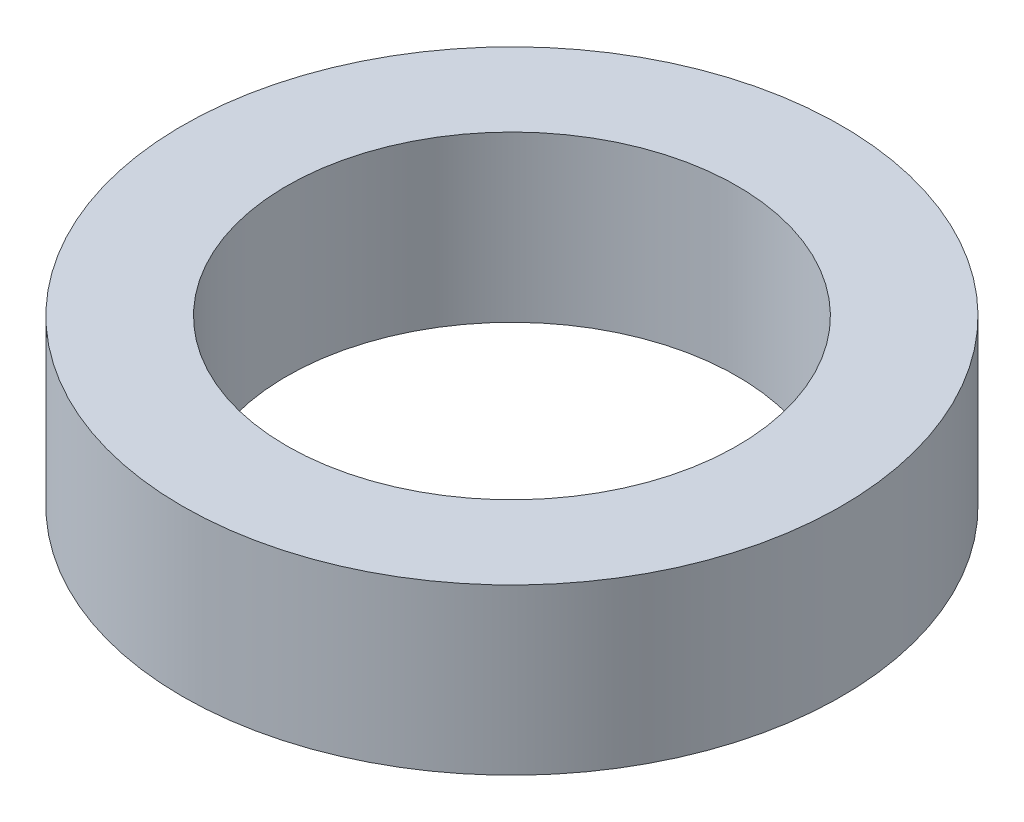
ISO-10303-21;
HEADER;
FILE_DESCRIPTION(('STEP AP214'),'2;1');
FILE_NAME('part.step','',(''),(''),'','','');
FILE_SCHEMA(('AUTOMOTIVE_DESIGN { 1 0 10303 214 1 1 1 1 }'));
ENDSEC;
DATA;
#1=APPLICATION_CONTEXT('core data for automotive mechanical design processes');
#2=APPLICATION_PROTOCOL_DEFINITION('international standard','automotive_design',2000,#1);
#3=PRODUCT_CONTEXT('',#1,'mechanical');
#4=PRODUCT('Part','Part','',(#3));
#5=PRODUCT_RELATED_PRODUCT_CATEGORY('part','',(#4));
#6=PRODUCT_DEFINITION_FORMATION('','',#4);
#7=PRODUCT_DEFINITION_CONTEXT('part definition',#1,'design');
#8=PRODUCT_DEFINITION('design','',#6,#7);
#9=PRODUCT_DEFINITION_SHAPE('','',#8);
#10=(LENGTH_UNIT() NAMED_UNIT(*) SI_UNIT(.MILLI.,.METRE.));
#11=(NAMED_UNIT(*) PLANE_ANGLE_UNIT() SI_UNIT($,.RADIAN.));
#12=(NAMED_UNIT(*) SI_UNIT($,.STERADIAN.) SOLID_ANGLE_UNIT());
#13=UNCERTAINTY_MEASURE_WITH_UNIT(LENGTH_MEASURE(1.E-05),#10,'distance_accuracy_value','');
#14=(GEOMETRIC_REPRESENTATION_CONTEXT(3) GLOBAL_UNCERTAINTY_ASSIGNED_CONTEXT((#13)) GLOBAL_UNIT_ASSIGNED_CONTEXT((#10,
#11,#12)) REPRESENTATION_CONTEXT('',''));
#15=CARTESIAN_POINT('',(0.,0.,0.));
#16=DIRECTION('',(0.,0.,1.));
#17=DIRECTION('',(1.,0.,0.));
#18=AXIS2_PLACEMENT_3D('',#15,#16,#17);
#19=CARTESIAN_POINT('',(0.,3.,0.));
#20=DIRECTION('',(0.,1.,0.));
#21=DIRECTION('',(0.,0.,1.));
#22=AXIS2_PLACEMENT_3D('',#19,#20,#21);
#23=PLANE('',#22);
#24=CARTESIAN_POINT('',(0.,3.,0.));
#25=DIRECTION('',(0.,1.,0.));
#26=DIRECTION('',(0.,0.,1.));
#27=AXIS2_PLACEMENT_3D('',#24,#25,#26);
#28=CIRCLE('',#27,6.);
#29=CARTESIAN_POINT('',(0.,3.,6.));
#30=VERTEX_POINT('',#29);
#31=EDGE_CURVE('E10',#30,#30,#28,.T.);
#32=ORIENTED_EDGE('',*,*,#31,.T.);
#33=EDGE_LOOP('',(#32));
#34=FACE_BOUND('',#33,.T.);
#35=CARTESIAN_POINT('',(0.,3.,0.));
#36=DIRECTION('',(0.,1.,0.));
#37=DIRECTION('',(0.,0.,1.));
#38=AXIS2_PLACEMENT_3D('',#35,#36,#37);
#39=CIRCLE('',#38,4.1);
#40=CARTESIAN_POINT('',(0.,3.,4.1));
#41=VERTEX_POINT('',#40);
#42=EDGE_CURVE('E50',#41,#41,#39,.T.);
#43=ORIENTED_EDGE('',*,*,#42,.F.);
#44=EDGE_LOOP('',(#43));
#45=FACE_BOUND('',#44,.T.);
#46=ADVANCED_FACE('F37',(#34,#45),#23,.T.);
#47=CARTESIAN_POINT('',(0.,0.,0.));
#48=DIRECTION('',(0.,1.,0.));
#49=DIRECTION('',(0.,0.,1.));
#50=AXIS2_PLACEMENT_3D('',#47,#48,#49);
#51=PLANE('',#50);
#52=CARTESIAN_POINT('',(0.,0.,0.));
#53=DIRECTION('',(0.,1.,0.));
#54=DIRECTION('',(0.,0.,1.));
#55=AXIS2_PLACEMENT_3D('',#52,#53,#54);
#56=CIRCLE('',#55,6.);
#57=CARTESIAN_POINT('',(0.,0.,6.));
#58=VERTEX_POINT('',#57);
#59=EDGE_CURVE('E41',#58,#58,#56,.T.);
#60=ORIENTED_EDGE('',*,*,#59,.F.);
#61=EDGE_LOOP('',(#60));
#62=FACE_BOUND('',#61,.T.);
#63=CARTESIAN_POINT('',(0.,0.,0.));
#64=DIRECTION('',(0.,1.,0.));
#65=DIRECTION('',(0.,0.,1.));
#66=AXIS2_PLACEMENT_3D('',#63,#64,#65);
#67=CIRCLE('',#66,4.1);
#68=CARTESIAN_POINT('',(0.,0.,4.1));
#69=VERTEX_POINT('',#68);
#70=EDGE_CURVE('E52',#69,#69,#67,.T.);
#71=ORIENTED_EDGE('',*,*,#70,.T.);
#72=EDGE_LOOP('',(#71));
#73=FACE_BOUND('',#72,.T.);
#74=ADVANCED_FACE('F64',(#62,#73),#51,.F.);
#75=CARTESIAN_POINT('',(0.,3.,0.));
#76=DIRECTION('',(0.,-1.,0.));
#77=DIRECTION('',(0.,0.,-1.));
#78=AXIS2_PLACEMENT_3D('',#75,#76,#77);
#79=CYLINDRICAL_SURFACE('',#78,6.);
#80=ORIENTED_EDGE('',*,*,#31,.F.);
#81=EDGE_LOOP('',(#80));
#82=FACE_BOUND('',#81,.T.);
#83=ORIENTED_EDGE('',*,*,#59,.T.);
#84=EDGE_LOOP('',(#83));
#85=FACE_BOUND('',#84,.T.);
#86=ADVANCED_FACE('F39',(#82,#85),#79,.T.);
#87=CARTESIAN_POINT('',(0.,3.,0.));
#88=DIRECTION('',(0.,-1.,0.));
#89=DIRECTION('',(0.,0.,-1.));
#90=AXIS2_PLACEMENT_3D('',#87,#88,#89);
#91=CYLINDRICAL_SURFACE('',#90,4.1);
#92=ORIENTED_EDGE('',*,*,#42,.T.);
#93=EDGE_LOOP('',(#92));
#94=FACE_BOUND('',#93,.T.);
#95=ORIENTED_EDGE('',*,*,#70,.F.);
#96=EDGE_LOOP('',(#95));
#97=FACE_BOUND('',#96,.T.);
#98=ADVANCED_FACE('F60',(#94,#97),#91,.F.);
#99=CLOSED_SHELL('',(#46,#74,#86,#98));
#100=MANIFOLD_SOLID_BREP('B2',#99);
#101=ADVANCED_BREP_SHAPE_REPRESENTATION('',(#18,#100),#14);
#102=SHAPE_DEFINITION_REPRESENTATION(#9,#101);
ENDSEC;
END-ISO-10303-21;
